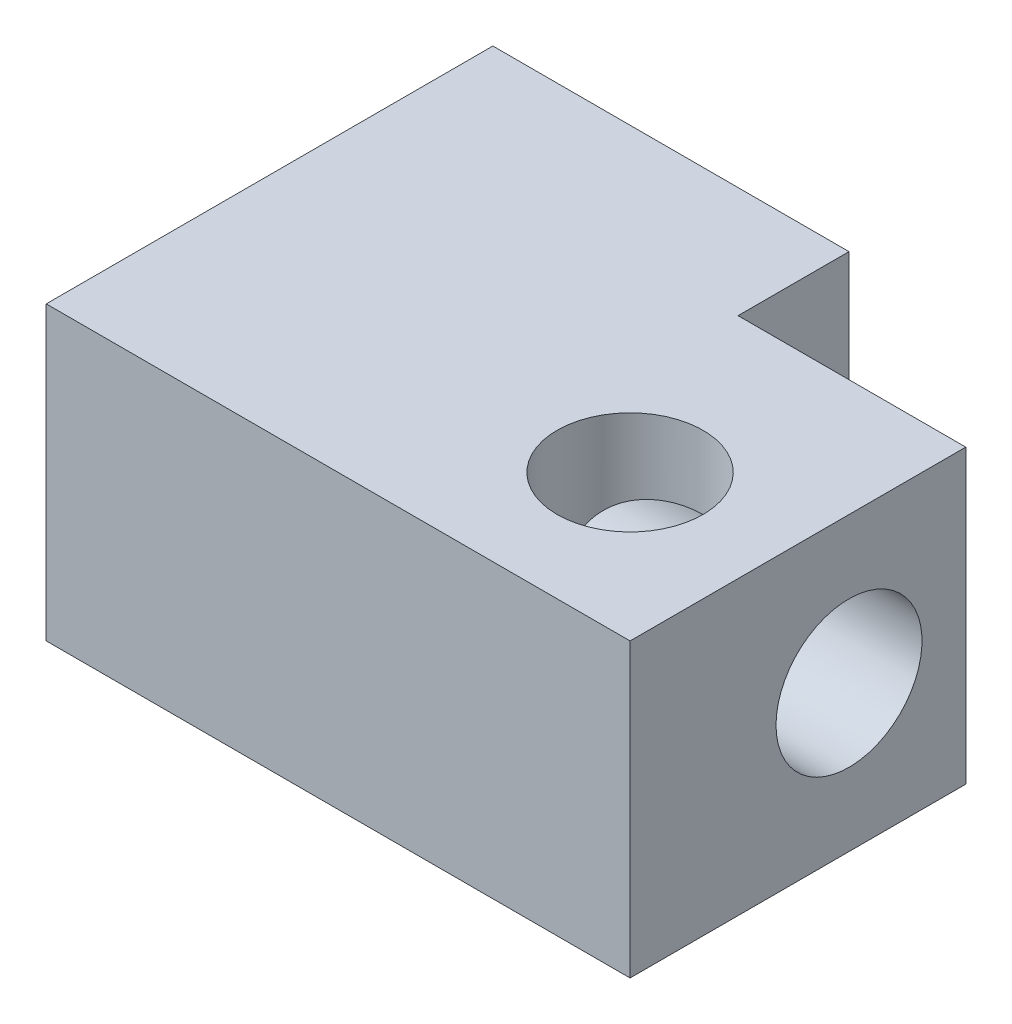
ISO-10303-21;
HEADER;
FILE_DESCRIPTION(('STEP AP214'),'2;1');
FILE_NAME('part.step','',(''),(''),'','','');
FILE_SCHEMA(('AUTOMOTIVE_DESIGN { 1 0 10303 214 1 1 1 1 }'));
ENDSEC;
DATA;
#1=APPLICATION_CONTEXT('core data for automotive mechanical design processes');
#2=APPLICATION_PROTOCOL_DEFINITION('international standard','automotive_design',2000,#1);
#3=PRODUCT_CONTEXT('',#1,'mechanical');
#4=PRODUCT('Part','Part','',(#3));
#5=PRODUCT_RELATED_PRODUCT_CATEGORY('part','',(#4));
#6=PRODUCT_DEFINITION_FORMATION('','',#4);
#7=PRODUCT_DEFINITION_CONTEXT('part definition',#1,'design');
#8=PRODUCT_DEFINITION('design','',#6,#7);
#9=PRODUCT_DEFINITION_SHAPE('','',#8);
#10=(LENGTH_UNIT() NAMED_UNIT(*) SI_UNIT(.MILLI.,.METRE.));
#11=(NAMED_UNIT(*) PLANE_ANGLE_UNIT() SI_UNIT($,.RADIAN.));
#12=(NAMED_UNIT(*) SI_UNIT($,.STERADIAN.) SOLID_ANGLE_UNIT());
#13=UNCERTAINTY_MEASURE_WITH_UNIT(LENGTH_MEASURE(1.E-05),#10,'distance_accuracy_value','');
#14=(GEOMETRIC_REPRESENTATION_CONTEXT(3) GLOBAL_UNCERTAINTY_ASSIGNED_CONTEXT((#13)) GLOBAL_UNIT_ASSIGNED_CONTEXT((#10,
#11,#12)) REPRESENTATION_CONTEXT('',''));
#15=CARTESIAN_POINT('',(0.,0.,0.));
#16=DIRECTION('',(0.,0.,1.));
#17=DIRECTION('',(1.,0.,0.));
#18=AXIS2_PLACEMENT_3D('',#15,#16,#17);
#19=CARTESIAN_POINT('',(7.50000000000001,5.,0.));
#20=DIRECTION('',(1.,0.,0.));
#21=DIRECTION('',(0.,0.,-1.));
#22=AXIS2_PLACEMENT_3D('',#19,#20,#21);
#23=PLANE('',#22);
#24=CARTESIAN_POINT('',(7.50000000000002,2.5,84.75));
#25=DIRECTION('',(-1.,0.,0.));
#26=DIRECTION('',(0.,0.,1.));
#27=AXIS2_PLACEMENT_3D('',#24,#25,#26);
#28=CIRCLE('',#27,1.25);
#29=CARTESIAN_POINT('',(7.50000000000002,2.5,86.));
#30=VERTEX_POINT('',#29);
#31=EDGE_CURVE('E185',#30,#30,#28,.T.);
#32=ORIENTED_EDGE('',*,*,#31,.T.);
#33=EDGE_LOOP('',(#32));
#34=FACE_BOUND('',#33,.T.);
#35=DIRECTION('',(0.,0.,1.));
#36=VECTOR('',#35,1.);
#37=CARTESIAN_POINT('',(7.50000000000001,0.,0.));
#38=LINE('',#37,#36);
#39=CARTESIAN_POINT('',(7.50000000000001,0.,82.75));
#40=VERTEX_POINT('',#39);
#41=CARTESIAN_POINT('',(7.50000000000001,0.,88.5));
#42=VERTEX_POINT('',#41);
#43=EDGE_CURVE('E127',#40,#42,#38,.T.);
#44=ORIENTED_EDGE('',*,*,#43,.F.);
#45=DIRECTION('',(0.,-1.,0.));
#46=VECTOR('',#45,1.);
#47=CARTESIAN_POINT('',(7.50000000000001,5.,82.75));
#48=LINE('',#47,#46);
#49=CARTESIAN_POINT('',(7.50000000000001,5.,82.75));
#50=VERTEX_POINT('',#49);
#51=EDGE_CURVE('E11',#50,#40,#48,.T.);
#52=ORIENTED_EDGE('',*,*,#51,.F.);
#53=DIRECTION('',(0.,0.,1.));
#54=VECTOR('',#53,1.);
#55=CARTESIAN_POINT('',(7.50000000000001,5.,0.));
#56=LINE('',#55,#54);
#57=CARTESIAN_POINT('',(7.50000000000001,5.,88.5));
#58=VERTEX_POINT('',#57);
#59=EDGE_CURVE('E191',#50,#58,#56,.T.);
#60=ORIENTED_EDGE('',*,*,#59,.T.);
#61=DIRECTION('',(0.,-1.,0.));
#62=VECTOR('',#61,1.);
#63=CARTESIAN_POINT('',(7.50000000000001,5.,88.5));
#64=LINE('',#63,#62);
#65=EDGE_CURVE('E59',#58,#42,#64,.T.);
#66=ORIENTED_EDGE('',*,*,#65,.T.);
#67=EDGE_LOOP('',(#44,#52,#60,#66));
#68=FACE_BOUND('',#67,.T.);
#69=ADVANCED_FACE('F36',(#34,#68),#23,.T.);
#70=CARTESIAN_POINT('',(0.,5.,82.75));
#71=DIRECTION('',(0.,0.,1.));
#72=DIRECTION('',(1.,0.,0.));
#73=AXIS2_PLACEMENT_3D('',#70,#71,#72);
#74=PLANE('',#73);
#75=DIRECTION('',(-1.,0.,0.));
#76=VECTOR('',#75,1.);
#77=CARTESIAN_POINT('',(0.,0.,82.75));
#78=LINE('',#77,#76);
#79=CARTESIAN_POINT('',(3.60000000000001,0.,82.75));
#80=VERTEX_POINT('',#79);
#81=EDGE_CURVE('E129',#40,#80,#78,.T.);
#82=ORIENTED_EDGE('',*,*,#81,.T.);
#83=DIRECTION('',(0.,-1.,0.));
#84=VECTOR('',#83,1.);
#85=CARTESIAN_POINT('',(3.60000000000001,5.,82.75));
#86=LINE('',#85,#84);
#87=CARTESIAN_POINT('',(3.60000000000001,5.,82.75));
#88=VERTEX_POINT('',#87);
#89=EDGE_CURVE('E51',#88,#80,#86,.T.);
#90=ORIENTED_EDGE('',*,*,#89,.F.);
#91=DIRECTION('',(-1.,0.,0.));
#92=VECTOR('',#91,1.);
#93=CARTESIAN_POINT('',(0.,5.,82.75));
#94=LINE('',#93,#92);
#95=EDGE_CURVE('E193',#50,#88,#94,.T.);
#96=ORIENTED_EDGE('',*,*,#95,.F.);
#97=ORIENTED_EDGE('',*,*,#51,.T.);
#98=EDGE_LOOP('',(#82,#90,#96,#97));
#99=FACE_BOUND('',#98,.T.);
#100=ADVANCED_FACE('F151',(#99),#74,.F.);
#101=CARTESIAN_POINT('',(3.60000000000001,5.,0.));
#102=DIRECTION('',(1.,0.,0.));
#103=DIRECTION('',(0.,0.,-1.));
#104=AXIS2_PLACEMENT_3D('',#101,#102,#103);
#105=PLANE('',#104);
#106=DIRECTION('',(0.,0.,1.));
#107=VECTOR('',#106,1.);
#108=CARTESIAN_POINT('',(3.60000000000001,0.,0.));
#109=LINE('',#108,#107);
#110=CARTESIAN_POINT('',(3.60000000000001,0.,80.85));
#111=VERTEX_POINT('',#110);
#112=EDGE_CURVE('E132',#111,#80,#109,.T.);
#113=ORIENTED_EDGE('',*,*,#112,.F.);
#114=DIRECTION('',(0.,-1.,0.));
#115=VECTOR('',#114,1.);
#116=CARTESIAN_POINT('',(3.60000000000001,5.,80.85));
#117=LINE('',#116,#115);
#118=CARTESIAN_POINT('',(3.60000000000001,5.,80.85));
#119=VERTEX_POINT('',#118);
#120=EDGE_CURVE('E116',#119,#111,#117,.T.);
#121=ORIENTED_EDGE('',*,*,#120,.F.);
#122=DIRECTION('',(0.,0.,1.));
#123=VECTOR('',#122,1.);
#124=CARTESIAN_POINT('',(3.60000000000001,5.,0.));
#125=LINE('',#124,#123);
#126=EDGE_CURVE('E106',#119,#88,#125,.T.);
#127=ORIENTED_EDGE('',*,*,#126,.T.);
#128=ORIENTED_EDGE('',*,*,#89,.T.);
#129=EDGE_LOOP('',(#113,#121,#127,#128));
#130=FACE_BOUND('',#129,.T.);
#131=ADVANCED_FACE('F148',(#130),#105,.T.);
#132=CARTESIAN_POINT('',(0.,5.,80.85));
#133=DIRECTION('',(0.,0.,1.));
#134=DIRECTION('',(1.,0.,0.));
#135=AXIS2_PLACEMENT_3D('',#132,#133,#134);
#136=PLANE('',#135);
#137=DIRECTION('',(-1.,0.,0.));
#138=VECTOR('',#137,1.);
#139=CARTESIAN_POINT('',(0.,0.,80.85));
#140=LINE('',#139,#138);
#141=CARTESIAN_POINT('',(-2.49999999999998,0.,80.85));
#142=VERTEX_POINT('',#141);
#143=EDGE_CURVE('E113',#111,#142,#140,.T.);
#144=ORIENTED_EDGE('',*,*,#143,.T.);
#145=DIRECTION('',(0.,-1.,0.));
#146=VECTOR('',#145,1.);
#147=CARTESIAN_POINT('',(-2.49999999999998,5.,80.85));
#148=LINE('',#147,#146);
#149=CARTESIAN_POINT('',(-2.49999999999998,5.,80.85));
#150=VERTEX_POINT('',#149);
#151=EDGE_CURVE('E110',#150,#142,#148,.T.);
#152=ORIENTED_EDGE('',*,*,#151,.F.);
#153=DIRECTION('',(-1.,0.,0.));
#154=VECTOR('',#153,1.);
#155=CARTESIAN_POINT('',(0.,5.,80.85));
#156=LINE('',#155,#154);
#157=EDGE_CURVE('E98',#119,#150,#156,.T.);
#158=ORIENTED_EDGE('',*,*,#157,.F.);
#159=ORIENTED_EDGE('',*,*,#120,.T.);
#160=EDGE_LOOP('',(#144,#152,#158,#159));
#161=FACE_BOUND('',#160,.T.);
#162=ADVANCED_FACE('F111',(#161),#136,.F.);
#163=CARTESIAN_POINT('',(-2.49999999999999,5.,0.));
#164=DIRECTION('',(-1.,0.,0.));
#165=DIRECTION('',(0.,0.,1.));
#166=AXIS2_PLACEMENT_3D('',#163,#164,#165);
#167=PLANE('',#166);
#168=CARTESIAN_POINT('',(-2.49999999999998,2.5,84.75));
#169=DIRECTION('',(-1.,0.,0.));
#170=DIRECTION('',(0.,0.,1.));
#171=AXIS2_PLACEMENT_3D('',#168,#169,#170);
#172=CIRCLE('',#171,1.25);
#173=CARTESIAN_POINT('',(-2.49999999999998,2.5,86.));
#174=VERTEX_POINT('',#173);
#175=EDGE_CURVE('E183',#174,#174,#172,.T.);
#176=ORIENTED_EDGE('',*,*,#175,.F.);
#177=EDGE_LOOP('',(#176));
#178=FACE_BOUND('',#177,.T.);
#179=DIRECTION('',(0.,0.,-1.));
#180=VECTOR('',#179,1.);
#181=CARTESIAN_POINT('',(-2.49999999999999,0.,0.));
#182=LINE('',#181,#180);
#183=CARTESIAN_POINT('',(-2.49999999999998,0.,88.5));
#184=VERTEX_POINT('',#183);
#185=EDGE_CURVE('E136',#184,#142,#182,.T.);
#186=ORIENTED_EDGE('',*,*,#185,.F.);
#187=DIRECTION('',(0.,-1.,0.));
#188=VECTOR('',#187,1.);
#189=CARTESIAN_POINT('',(-2.49999999999998,5.,88.5));
#190=LINE('',#189,#188);
#191=CARTESIAN_POINT('',(-2.49999999999998,5.,88.5));
#192=VERTEX_POINT('',#191);
#193=EDGE_CURVE('E78',#192,#184,#190,.T.);
#194=ORIENTED_EDGE('',*,*,#193,.F.);
#195=DIRECTION('',(0.,0.,-1.));
#196=VECTOR('',#195,1.);
#197=CARTESIAN_POINT('',(-2.49999999999999,5.,0.));
#198=LINE('',#197,#196);
#199=EDGE_CURVE('E104',#192,#150,#198,.T.);
#200=ORIENTED_EDGE('',*,*,#199,.T.);
#201=ORIENTED_EDGE('',*,*,#151,.T.);
#202=EDGE_LOOP('',(#186,#194,#200,#201));
#203=FACE_BOUND('',#202,.T.);
#204=ADVANCED_FACE('F118',(#178,#203),#167,.T.);
#205=CARTESIAN_POINT('',(5.00000000000084,5.,86.));
#206=DIRECTION('',(0.,-1.,0.));
#207=DIRECTION('',(0.,0.,-1.));
#208=AXIS2_PLACEMENT_3D('',#205,#206,#207);
#209=CYLINDRICAL_SURFACE('',#208,1.25);
#210=CARTESIAN_POINT('',(5.00000000000084,3.75,84.75));
#211=CARTESIAN_POINT('',(4.93038791797707,3.7500033558061,84.7500021347025));
#212=CARTESIAN_POINT('',(4.8607520893775,3.75004170118305,84.7558313770004));
#213=CARTESIAN_POINT('',(4.72337762145951,3.74971562826646,84.7790008984842));
#214=CARTESIAN_POINT('',(4.65564052499716,3.74935089164191,84.7963502712858));
#215=CARTESIAN_POINT('',(4.52393092111439,3.74681223178613,84.8421042621616));
#216=CARTESIAN_POINT('',(4.45996323821517,3.74463604169126,84.8705227084195));
#217=CARTESIAN_POINT('',(4.33784059706926,3.73631466046054,84.9375091377932));
#218=CARTESIAN_POINT('',(4.27968352258774,3.73017092044326,84.9760734070522));
#219=CARTESIAN_POINT('',(4.17331318675624,3.71166627926564,85.0600558017887));
#220=CARTESIAN_POINT('',(4.1247992425869,3.69955884502476,85.1051455344101));
#221=CARTESIAN_POINT('',(4.03675041359965,3.66699666627189,85.200717403511));
#222=CARTESIAN_POINT('',(3.99720091421676,3.64655566235216,85.2511905629941));
#223=CARTESIAN_POINT('',(3.93278067438098,3.59934157849852,85.3469924673292));
#224=CARTESIAN_POINT('',(3.90664480449175,3.57380872661441,85.3920865869244));
#225=CARTESIAN_POINT('',(3.86170516561568,3.51530466467926,85.4810868318676));
#226=CARTESIAN_POINT('',(3.84290159451375,3.48233325391343,85.5249929251232));
#227=CARTESIAN_POINT('',(3.81269512168914,3.41167129701444,85.6068025573928));
#228=CARTESIAN_POINT('',(3.8009266541825,3.37436469301849,85.6449064713919));
#229=CARTESIAN_POINT('',(3.7820117652387,3.29452710556952,85.716490897934));
#230=CARTESIAN_POINT('',(3.7748668564855,3.25199441771504,85.7499698945337));
#231=CARTESIAN_POINT('',(3.76339285192592,3.15823380971361,85.814318134905));
#232=CARTESIAN_POINT('',(3.75941248352011,3.1065619286813,85.8446010281686));
#233=CARTESIAN_POINT('',(3.75392479390101,2.99931042312478,85.8975065401068));
#234=CARTESIAN_POINT('',(3.75241881464301,2.94372869516968,85.9201249967918));
#235=CARTESIAN_POINT('',(3.75048001793217,2.82274720210579,85.9594904995483));
#236=CARTESIAN_POINT('',(3.7502048850909,2.75698867064902,85.9751501386427));
#237=CARTESIAN_POINT('',(3.74996531428086,2.62380822483296,85.9956784117589));
#238=CARTESIAN_POINT('',(3.75000092943722,2.55638602802009,86.0005452004693));
#239=CARTESIAN_POINT('',(3.7499990340441,2.41883941795821,85.9993335565702));
#240=CARTESIAN_POINT('',(3.74995843909085,2.34871853899281,85.9927942534782));
#241=CARTESIAN_POINT('',(3.7503482333396,2.21054143998913,85.9680487393185));
#242=CARTESIAN_POINT('',(3.75077880175288,2.14248601568743,85.9498380900396));
#243=CARTESIAN_POINT('',(3.75360064624335,2.01035190660499,85.9022495818011));
#244=CARTESIAN_POINT('',(3.75599374706384,1.94627698252353,85.8728613436709));
#245=CARTESIAN_POINT('',(3.76499344379867,1.82417323358956,85.8038810242477));
#246=CARTESIAN_POINT('',(3.77159836155756,1.76614201139397,85.7642930106933));
#247=CARTESIAN_POINT('',(3.79121117292335,1.66087589652267,85.6788332669613));
#248=CARTESIAN_POINT('',(3.80388249763144,1.61324633060539,85.6333745589749));
#249=CARTESIAN_POINT('',(3.83766088179841,1.5270094335031,85.5373592401222));
#250=CARTESIAN_POINT('',(3.85875403698952,1.48838739674516,85.4868111341066));
#251=CARTESIAN_POINT('',(3.90712787321914,1.42569483722976,85.3912360325713));
#252=CARTESIAN_POINT('',(3.93316013511014,1.40035405930869,85.3464047503039));
#253=CARTESIAN_POINT('',(3.99255380568758,1.35687664120273,85.2581249547861));
#254=CARTESIAN_POINT('',(4.0259157889991,1.33874056615512,85.2146765502544));
#255=CARTESIAN_POINT('',(4.0974444640301,1.30956813041756,85.1335877685099));
#256=CARTESIAN_POINT('',(4.13527812553611,1.29821607958067,85.0957639884472));
#257=CARTESIAN_POINT('',(4.21610635173645,1.28004280044355,85.0248566298701));
#258=CARTESIAN_POINT('',(4.25910262295872,1.27322307522254,84.9917746267463));
#259=CARTESIAN_POINT('',(4.3539609749727,1.26230566363698,84.9282160395455));
#260=CARTESIAN_POINT('',(4.40628008417681,1.25856219304606,84.8983621961735));
#261=CARTESIAN_POINT('',(4.51476507719435,1.2534536227878,84.8464534516357));
#262=CARTESIAN_POINT('',(4.57093302020044,1.25208980676652,84.8244027647997));
#263=CARTESIAN_POINT('',(4.6929463513506,1.25036639768356,84.7864174144587));
#264=CARTESIAN_POINT('',(4.75913335542106,1.25015061471084,84.7715656769441));
#265=CARTESIAN_POINT('',(4.89303702604963,1.24996763393157,84.752749658674));
#266=CARTESIAN_POINT('',(4.96075393622977,1.2500004759982,84.7487871244107));
#267=CARTESIAN_POINT('',(5.09852385008594,1.2499995901791,84.7519144510518));
#268=CARTESIAN_POINT('',(5.16856762166624,1.24996327980412,84.7594309137238));
#269=CARTESIAN_POINT('',(5.30642799173021,1.25045151296893,84.7861080113089));
#270=CARTESIAN_POINT('',(5.3742437016072,1.25097627754662,84.8052732340174));
#271=CARTESIAN_POINT('',(5.50569413767458,1.25414747737534,84.8547033903236));
#272=CARTESIAN_POINT('',(5.56932748023674,1.2567946109728,84.8849719756041));
#273=CARTESIAN_POINT('',(5.69037904301804,1.26651155906022,84.955597663157));
#274=CARTESIAN_POINT('',(5.7478002772486,1.2735792173948,84.995949841297));
#275=CARTESIAN_POINT('',(5.85148646385369,1.29426432070598,85.0825152442898));
#276=CARTESIAN_POINT('',(5.89818786384033,1.3075053217626,85.1282913040849));
#277=CARTESIAN_POINT('',(5.98254540713859,1.34249213800239,85.2246378383449));
#278=CARTESIAN_POINT('',(6.02021591735477,1.36422429808699,85.2752005167561));
#279=CARTESIAN_POINT('',(6.08118271132107,1.41373028414856,85.370476848518));
#280=CARTESIAN_POINT('',(6.1057452197654,1.44025655763784,85.4150347952149));
#281=CARTESIAN_POINT('',(6.14779461635171,1.50052783570431,85.5025797802186));
#282=CARTESIAN_POINT('',(6.16528066153484,1.5342736995584,85.5455666308196));
#283=CARTESIAN_POINT('',(6.19344583853964,1.60666914478757,85.6259332987859));
#284=CARTESIAN_POINT('',(6.20439165782753,1.6450360795633,85.6634769604646));
#285=CARTESIAN_POINT('',(6.2218426880378,1.72686928004552,85.7337072277934));
#286=CARTESIAN_POINT('',(6.22834639431998,1.77033726775317,85.7663921847646));
#287=CARTESIAN_POINT('',(6.23872129134199,1.86630353774611,85.8291473122165));
#288=CARTESIAN_POINT('',(6.24223446979949,1.91927026078918,85.8585590163));
#289=CARTESIAN_POINT('',(6.24697775071305,2.02898758021982,85.9094441664789));
#290=CARTESIAN_POINT('',(6.24820663287301,2.08574018230663,85.9309133646988));
#291=CARTESIAN_POINT('',(6.24972917501987,2.20876476667331,85.967487964113));
#292=CARTESIAN_POINT('',(6.24989257454416,2.27536070660565,85.9815173891319));
#293=CARTESIAN_POINT('',(6.25002833884989,2.40994553267335,85.9985970916655));
#294=CARTESIAN_POINT('',(6.25000067464437,2.47793462860933,86.0016457031347));
#295=CARTESIAN_POINT('',(6.2499987320161,2.6158872811322,85.9965942638138));
#296=CARTESIAN_POINT('',(6.25002635267979,2.6858368233067,85.9881009540032));
#297=CARTESIAN_POINT('',(6.24942437843676,2.8233463285686,85.9594963411097));
#298=CARTESIAN_POINT('',(6.2487945166503,2.89090530978672,85.9393803217148));
#299=CARTESIAN_POINT('',(6.24524729932179,3.02163651082601,85.8881220793567));
#300=CARTESIAN_POINT('',(6.24233063451407,3.08481004900971,85.856983187436));
#301=CARTESIAN_POINT('',(6.23186359713286,3.20477345591413,85.7847391093133));
#302=CARTESIAN_POINT('',(6.22431591333233,3.26156700623992,85.7436397145574));
#303=CARTESIAN_POINT('',(6.20253436134219,3.36364132852682,85.6560220190676));
#304=CARTESIAN_POINT('',(6.188719128613,3.40940230321811,85.6099636260909));
#305=CARTESIAN_POINT('',(6.15252743082786,3.49186734215065,85.513358208184));
#306=CARTESIAN_POINT('',(6.13016423414347,3.52858529867646,85.4628182325949));
#307=CARTESIAN_POINT('',(6.07954309402928,3.58784921953402,85.3678844384003));
#308=CARTESIAN_POINT('',(6.05252686453138,3.61165244808968,85.323606457071));
#309=CARTESIAN_POINT('',(5.99138644402213,3.65231087075096,85.2368038839195));
#310=CARTESIAN_POINT('',(5.95726130983298,3.66916514201502,85.194279525658));
#311=CARTESIAN_POINT('',(5.88399825626478,3.69634915173573,85.1146358971997));
#312=CARTESIAN_POINT('',(5.84509383321794,3.70689813748655,85.0773744649223));
#313=CARTESIAN_POINT('',(5.76224143174776,3.72364610948475,85.0078217986497));
#314=CARTESIAN_POINT('',(5.71829122335339,3.72984316373062,84.975532777072));
#315=CARTESIAN_POINT('',(5.62119535936326,3.73969059486377,84.9135876316312));
#316=CARTESIAN_POINT('',(5.56757079701499,3.74298006728528,84.8846262673125));
#317=CARTESIAN_POINT('',(5.45661756209331,3.74737215732311,84.8347952522022));
#318=CARTESIAN_POINT('',(5.39928855344494,3.74847457623702,84.8139263367799));
#319=CARTESIAN_POINT('',(5.28540748220832,3.74969754606906,84.7816605541001));
#320=CARTESIAN_POINT('',(5.22898443842626,3.74986850415371,84.7698080281505));
#321=CARTESIAN_POINT('',(5.1150463939637,3.7500183520458,84.7539765558046));
#322=CARTESIAN_POINT('',(5.05753130678387,3.74999722657469,84.7499982357628));
#323=CARTESIAN_POINT('',(5.00000000000084,3.75,84.75));
#324=B_SPLINE_CURVE_WITH_KNOTS('',3,(#210,#211,#212,#213,#214,#215,#216,#217,#218,#219,#220,
#221,#222,#223,#224,#225,#226,#227,#228,#229,#230,#231,#232,#233,#234,#235,#236,#237,#238,#239,
#240,#241,#242,#243,#244,#245,#246,#247,#248,#249,#250,#251,#252,#253,#254,#255,#256,#257,#258,
#259,#260,#261,#262,#263,#264,#265,#266,#267,#268,#269,#270,#271,#272,#273,#274,#275,#276,#277,
#278,#279,#280,#281,#282,#283,#284,#285,#286,#287,#288,#289,#290,#291,#292,#293,#294,#295,#296,
#297,#298,#299,#300,#301,#302,#303,#304,#305,#306,#307,#308,#309,#310,#311,#312,#313,#314,#315,
#316,#317,#318,#319,#320,#321,#322,#323),.UNSPECIFIED.,.T.,.F.,(4,2,2,2,2,2,2,2,2,2,2,2,2,2,2,2,
2,2,2,2,2,2,2,2,2,2,2,2,2,2,2,2,2,2,2,2,2,2,2,2,2,2,2,2,2,2,2,2,2,2,2,2,2,2,2,2,4),(0.,
0.208635853058989,0.417436592556167,0.626499020055713,0.835485026919859,1.03626900279049,
1.2367232515091,1.40989905564516,1.58307953314627,1.74622940236773,1.9094326221783,
2.0887904403309,2.26824549897724,2.47013348722586,2.67205599068608,2.88232735327898,
3.0926787223127,3.30322589602162,3.51368923173189,3.71363214752704,3.91324631771993,
4.08543282663772,4.2576328392086,4.42102516331616,4.58447164708458,4.76481230506923,
4.94525021334122,5.14783584231473,5.35045396159617,5.5607874316386,5.77120379400174,
5.98168942040356,6.19207246030313,6.39103309312867,6.5896750747136,6.76090552970105,
6.93215637591606,7.09583847723659,7.25957599378236,7.44090954126656,7.62233993130793,
7.82559178979603,8.02887448503355,8.23925993141408,8.44973080890381,8.66013813764085,
8.87042341917873,9.06836080425883,9.26599218535639,9.43631189364914,9.60665421361016,
9.77066437891941,9.93474730914124,10.1171215855154,10.2995124305504,10.4719270207555,
10.6443553251435),.UNSPECIFIED.);
#325=CARTESIAN_POINT('',(5.00000000000084,3.75,84.75));
#326=VERTEX_POINT('',#325);
#327=EDGE_CURVE('E41',#326,#326,#324,.T.);
#328=ORIENTED_EDGE('',*,*,#327,.F.);
#329=EDGE_LOOP('',(#328));
#330=FACE_BOUND('',#329,.T.);
#331=CARTESIAN_POINT('',(5.00000000000084,5.,86.));
#332=DIRECTION('',(0.,1.,0.));
#333=DIRECTION('',(0.,0.,1.));
#334=AXIS2_PLACEMENT_3D('',#331,#332,#333);
#335=CIRCLE('',#334,1.25);
#336=CARTESIAN_POINT('',(5.00000000000084,5.,87.25));
#337=VERTEX_POINT('',#336);
#338=EDGE_CURVE('E141',#337,#337,#335,.T.);
#339=ORIENTED_EDGE('',*,*,#338,.T.);
#340=EDGE_LOOP('',(#339));
#341=FACE_BOUND('',#340,.T.);
#342=CARTESIAN_POINT('',(5.00000000000084,0.,86.));
#343=DIRECTION('',(0.,1.,0.));
#344=DIRECTION('',(0.,0.,1.));
#345=AXIS2_PLACEMENT_3D('',#342,#343,#344);
#346=CIRCLE('',#345,1.25);
#347=CARTESIAN_POINT('',(5.00000000000084,0.,87.25));
#348=VERTEX_POINT('',#347);
#349=EDGE_CURVE('E124',#348,#348,#346,.T.);
#350=ORIENTED_EDGE('',*,*,#349,.F.);
#351=EDGE_LOOP('',(#350));
#352=FACE_BOUND('',#351,.T.);
#353=ADVANCED_FACE('F38',(#330,#341,#352),#209,.F.);
#354=CARTESIAN_POINT('',(0.,5.,88.5));
#355=DIRECTION('',(0.,0.,1.));
#356=DIRECTION('',(1.,0.,0.));
#357=AXIS2_PLACEMENT_3D('',#354,#355,#356);
#358=PLANE('',#357);
#359=DIRECTION('',(-1.,0.,0.));
#360=VECTOR('',#359,1.);
#361=CARTESIAN_POINT('',(0.,0.,88.5));
#362=LINE('',#361,#360);
#363=EDGE_CURVE('E138',#42,#184,#362,.T.);
#364=ORIENTED_EDGE('',*,*,#363,.F.);
#365=ORIENTED_EDGE('',*,*,#65,.F.);
#366=DIRECTION('',(-1.,0.,0.));
#367=VECTOR('',#366,1.);
#368=CARTESIAN_POINT('',(0.,5.,88.5));
#369=LINE('',#368,#367);
#370=EDGE_CURVE('E119',#58,#192,#369,.T.);
#371=ORIENTED_EDGE('',*,*,#370,.T.);
#372=ORIENTED_EDGE('',*,*,#193,.T.);
#373=EDGE_LOOP('',(#364,#365,#371,#372));
#374=FACE_BOUND('',#373,.T.);
#375=ADVANCED_FACE('F154',(#374),#358,.T.);
#376=CARTESIAN_POINT('',(0.,5.,0.));
#377=DIRECTION('',(0.,1.,0.));
#378=DIRECTION('',(0.,0.,1.));
#379=AXIS2_PLACEMENT_3D('',#376,#377,#378);
#380=PLANE('',#379);
#381=ORIENTED_EDGE('',*,*,#338,.F.);
#382=EDGE_LOOP('',(#381));
#383=FACE_BOUND('',#382,.T.);
#384=ORIENTED_EDGE('',*,*,#59,.F.);
#385=ORIENTED_EDGE('',*,*,#95,.T.);
#386=ORIENTED_EDGE('',*,*,#126,.F.);
#387=ORIENTED_EDGE('',*,*,#157,.T.);
#388=ORIENTED_EDGE('',*,*,#199,.F.);
#389=ORIENTED_EDGE('',*,*,#370,.F.);
#390=EDGE_LOOP('',(#384,#385,#386,#387,#388,#389));
#391=FACE_BOUND('',#390,.T.);
#392=ADVANCED_FACE('F101',(#383,#391),#380,.T.);
#393=CARTESIAN_POINT('',(0.,0.,0.));
#394=DIRECTION('',(0.,1.,0.));
#395=DIRECTION('',(0.,0.,1.));
#396=AXIS2_PLACEMENT_3D('',#393,#394,#395);
#397=PLANE('',#396);
#398=ORIENTED_EDGE('',*,*,#349,.T.);
#399=EDGE_LOOP('',(#398));
#400=FACE_BOUND('',#399,.T.);
#401=ORIENTED_EDGE('',*,*,#43,.T.);
#402=ORIENTED_EDGE('',*,*,#363,.T.);
#403=ORIENTED_EDGE('',*,*,#185,.T.);
#404=ORIENTED_EDGE('',*,*,#143,.F.);
#405=ORIENTED_EDGE('',*,*,#112,.T.);
#406=ORIENTED_EDGE('',*,*,#81,.F.);
#407=EDGE_LOOP('',(#401,#402,#403,#404,#405,#406));
#408=FACE_BOUND('',#407,.T.);
#409=ADVANCED_FACE('F153',(#400,#408),#397,.F.);
#410=CARTESIAN_POINT('',(7.50000000000002,2.5,84.75));
#411=DIRECTION('',(-1.,0.,0.));
#412=DIRECTION('',(0.,0.,1.));
#413=AXIS2_PLACEMENT_3D('',#410,#411,#412);
#414=CYLINDRICAL_SURFACE('',#413,1.25);
#415=ORIENTED_EDGE('',*,*,#327,.T.);
#416=EDGE_LOOP('',(#415));
#417=FACE_BOUND('',#416,.T.);
#418=ORIENTED_EDGE('',*,*,#31,.F.);
#419=EDGE_LOOP('',(#418));
#420=FACE_BOUND('',#419,.T.);
#421=ORIENTED_EDGE('',*,*,#175,.T.);
#422=EDGE_LOOP('',(#421));
#423=FACE_BOUND('',#422,.T.);
#424=ADVANCED_FACE('F200',(#417,#420,#423),#414,.F.);
#425=CLOSED_SHELL('',(#69,#100,#131,#162,#204,#353,#375,#392,#409,#424));
#426=MANIFOLD_SOLID_BREP('B2',#425);
#427=ADVANCED_BREP_SHAPE_REPRESENTATION('',(#18,#426),#14);
#428=SHAPE_DEFINITION_REPRESENTATION(#9,#427);
ENDSEC;
END-ISO-10303-21;
